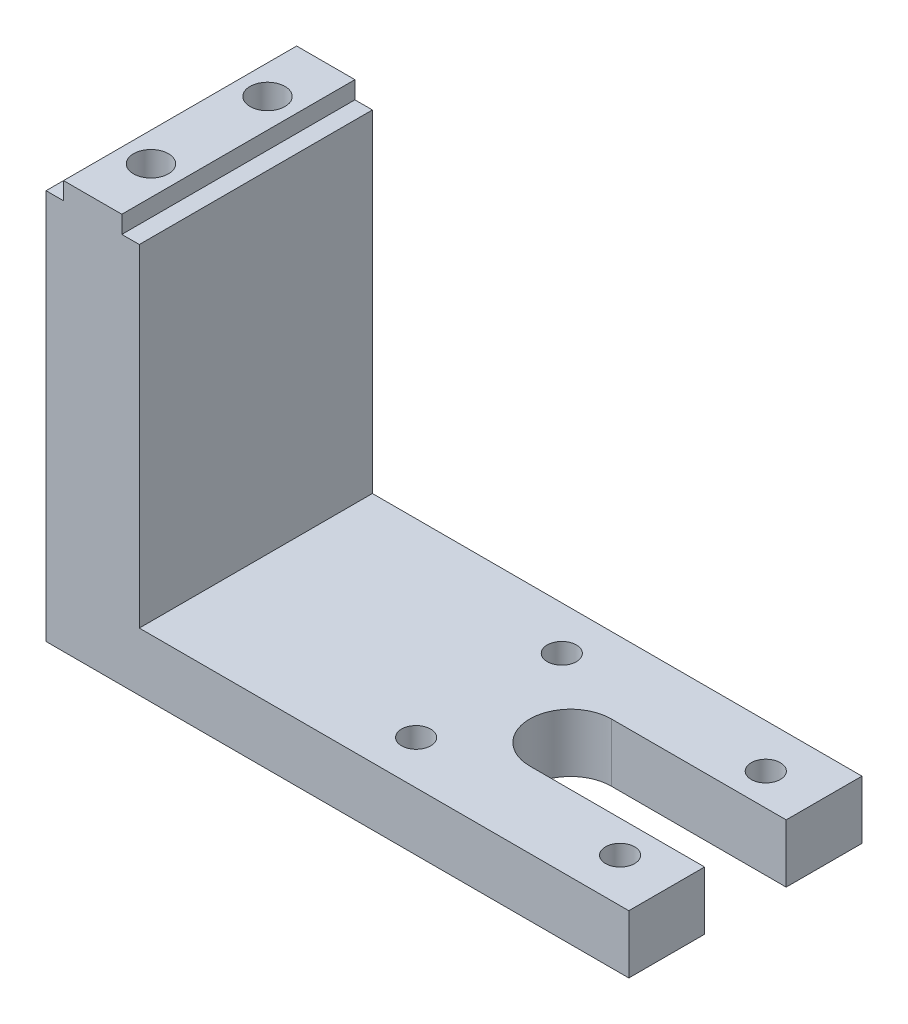
ISO-10303-21;
HEADER;
FILE_DESCRIPTION(('STEP AP214'),'2;1');
FILE_NAME('part.step','',(''),(''),'','','');
FILE_SCHEMA(('AUTOMOTIVE_DESIGN { 1 0 10303 214 1 1 1 1 }'));
ENDSEC;
DATA;
#1=APPLICATION_CONTEXT('core data for automotive mechanical design processes');
#2=APPLICATION_PROTOCOL_DEFINITION('international standard','automotive_design',2000,#1);
#3=PRODUCT_CONTEXT('',#1,'mechanical');
#4=PRODUCT('Part','Part','',(#3));
#5=PRODUCT_RELATED_PRODUCT_CATEGORY('part','',(#4));
#6=PRODUCT_DEFINITION_FORMATION('','',#4);
#7=PRODUCT_DEFINITION_CONTEXT('part definition',#1,'design');
#8=PRODUCT_DEFINITION('design','',#6,#7);
#9=PRODUCT_DEFINITION_SHAPE('','',#8);
#10=(LENGTH_UNIT() NAMED_UNIT(*) SI_UNIT(.MILLI.,.METRE.));
#11=(NAMED_UNIT(*) PLANE_ANGLE_UNIT() SI_UNIT($,.RADIAN.));
#12=(NAMED_UNIT(*) SI_UNIT($,.STERADIAN.) SOLID_ANGLE_UNIT());
#13=UNCERTAINTY_MEASURE_WITH_UNIT(LENGTH_MEASURE(1.E-05),#10,'distance_accuracy_value','');
#14=(GEOMETRIC_REPRESENTATION_CONTEXT(3) GLOBAL_UNCERTAINTY_ASSIGNED_CONTEXT((#13)) GLOBAL_UNIT_ASSIGNED_CONTEXT((#10,
#11,#12)) REPRESENTATION_CONTEXT('',''));
#15=CARTESIAN_POINT('',(0.,0.,0.));
#16=DIRECTION('',(0.,0.,1.));
#17=DIRECTION('',(1.,0.,0.));
#18=AXIS2_PLACEMENT_3D('',#15,#16,#17);
#19=CARTESIAN_POINT('',(84.,0.,20.));
#20=DIRECTION('',(-1.,0.,0.));
#21=DIRECTION('',(0.,0.,1.));
#22=AXIS2_PLACEMENT_3D('',#19,#20,#21);
#23=PLANE('',#22);
#24=DIRECTION('',(0.,0.,-1.));
#25=VECTOR('',#24,1.);
#26=CARTESIAN_POINT('',(84.,-10.,20.));
#27=LINE('',#26,#25);
#28=CARTESIAN_POINT('',(84.,-10.,20.));
#29=VERTEX_POINT('',#28);
#30=CARTESIAN_POINT('',(84.,-10.,7.));
#31=VERTEX_POINT('',#30);
#32=EDGE_CURVE('E139',#29,#31,#27,.T.);
#33=ORIENTED_EDGE('',*,*,#32,.T.);
#34=DIRECTION('',(0.,1.,0.));
#35=VECTOR('',#34,1.);
#36=CARTESIAN_POINT('',(84.,-10.,7.));
#37=LINE('',#36,#35);
#38=CARTESIAN_POINT('',(84.,0.,7.));
#39=VERTEX_POINT('',#38);
#40=EDGE_CURVE('E242',#31,#39,#37,.T.);
#41=ORIENTED_EDGE('',*,*,#40,.T.);
#42=DIRECTION('',(0.,0.,-1.));
#43=VECTOR('',#42,1.);
#44=CARTESIAN_POINT('',(84.,0.,20.));
#45=LINE('',#44,#43);
#46=CARTESIAN_POINT('',(84.,0.,20.));
#47=VERTEX_POINT('',#46);
#48=EDGE_CURVE('E150',#47,#39,#45,.T.);
#49=ORIENTED_EDGE('',*,*,#48,.F.);
#50=DIRECTION('',(0.,1.,0.));
#51=VECTOR('',#50,1.);
#52=CARTESIAN_POINT('',(84.,0.,20.));
#53=LINE('',#52,#51);
#54=EDGE_CURVE('E129',#29,#47,#53,.T.);
#55=ORIENTED_EDGE('',*,*,#54,.F.);
#56=EDGE_LOOP('',(#33,#41,#49,#55));
#57=FACE_BOUND('',#56,.T.);
#58=ADVANCED_FACE('F33',(#57),#23,.F.);
#59=CARTESIAN_POINT('',(0.,57.,20.));
#60=DIRECTION('',(-1.,0.,0.));
#61=DIRECTION('',(0.,0.,1.));
#62=AXIS2_PLACEMENT_3D('',#59,#60,#61);
#63=PLANE('',#62);
#64=DIRECTION('',(0.,1.,0.));
#65=VECTOR('',#64,1.);
#66=CARTESIAN_POINT('',(0.,57.,-20.));
#67=LINE('',#66,#65);
#68=CARTESIAN_POINT('',(0.,0.,-20.));
#69=VERTEX_POINT('',#68);
#70=CARTESIAN_POINT('',(0.,57.,-20.));
#71=VERTEX_POINT('',#70);
#72=EDGE_CURVE('E156',#69,#71,#67,.T.);
#73=ORIENTED_EDGE('',*,*,#72,.T.);
#74=DIRECTION('',(0.,0.,-1.));
#75=VECTOR('',#74,1.);
#76=CARTESIAN_POINT('',(0.,57.,20.));
#77=LINE('',#76,#75);
#78=CARTESIAN_POINT('',(0.,57.,20.));
#79=VERTEX_POINT('',#78);
#80=EDGE_CURVE('E11',#79,#71,#77,.T.);
#81=ORIENTED_EDGE('',*,*,#80,.F.);
#82=DIRECTION('',(0.,1.,0.));
#83=VECTOR('',#82,1.);
#84=CARTESIAN_POINT('',(0.,57.,20.));
#85=LINE('',#84,#83);
#86=CARTESIAN_POINT('',(0.,0.,20.));
#87=VERTEX_POINT('',#86);
#88=EDGE_CURVE('E179',#87,#79,#85,.T.);
#89=ORIENTED_EDGE('',*,*,#88,.F.);
#90=DIRECTION('',(0.,0.,-1.));
#91=VECTOR('',#90,1.);
#92=CARTESIAN_POINT('',(0.,0.,20.));
#93=LINE('',#92,#91);
#94=EDGE_CURVE('E152',#87,#69,#93,.T.);
#95=ORIENTED_EDGE('',*,*,#94,.T.);
#96=EDGE_LOOP('',(#73,#81,#89,#95));
#97=FACE_BOUND('',#96,.T.);
#98=ADVANCED_FACE('F35',(#97),#63,.F.);
#99=CARTESIAN_POINT('',(-3.,57.,20.));
#100=DIRECTION('',(0.,-1.,0.));
#101=DIRECTION('',(0.,0.,-1.));
#102=AXIS2_PLACEMENT_3D('',#99,#100,#101);
#103=PLANE('',#102);
#104=DIRECTION('',(-1.,0.,0.));
#105=VECTOR('',#104,1.);
#106=CARTESIAN_POINT('',(-3.,57.,-20.));
#107=LINE('',#106,#105);
#108=CARTESIAN_POINT('',(-3.,57.,-20.));
#109=VERTEX_POINT('',#108);
#110=EDGE_CURVE('E159',#71,#109,#107,.T.);
#111=ORIENTED_EDGE('',*,*,#110,.T.);
#112=DIRECTION('',(0.,0.,-1.));
#113=VECTOR('',#112,1.);
#114=CARTESIAN_POINT('',(-3.,57.,20.));
#115=LINE('',#114,#113);
#116=CARTESIAN_POINT('',(-3.,57.,20.));
#117=VERTEX_POINT('',#116);
#118=EDGE_CURVE('E41',#117,#109,#115,.T.);
#119=ORIENTED_EDGE('',*,*,#118,.F.);
#120=DIRECTION('',(-1.,0.,0.));
#121=VECTOR('',#120,1.);
#122=CARTESIAN_POINT('',(-3.,57.,20.));
#123=LINE('',#122,#121);
#124=EDGE_CURVE('E103',#79,#117,#123,.T.);
#125=ORIENTED_EDGE('',*,*,#124,.F.);
#126=ORIENTED_EDGE('',*,*,#80,.T.);
#127=EDGE_LOOP('',(#111,#119,#125,#126));
#128=FACE_BOUND('',#127,.T.);
#129=ADVANCED_FACE('F333',(#128),#103,.F.);
#130=CARTESIAN_POINT('',(-3.00000000000001,60.,20.));
#131=DIRECTION('',(-1.,0.,0.));
#132=DIRECTION('',(0.,-1.,0.));
#133=AXIS2_PLACEMENT_3D('',#130,#131,#132);
#134=PLANE('',#133);
#135=DIRECTION('',(0.,1.,0.));
#136=VECTOR('',#135,1.);
#137=CARTESIAN_POINT('',(-3.00000000000001,60.,-20.));
#138=LINE('',#137,#136);
#139=CARTESIAN_POINT('',(-3.00000000000001,60.,-20.));
#140=VERTEX_POINT('',#139);
#141=EDGE_CURVE('E162',#109,#140,#138,.T.);
#142=ORIENTED_EDGE('',*,*,#141,.T.);
#143=DIRECTION('',(0.,0.,-1.));
#144=VECTOR('',#143,1.);
#145=CARTESIAN_POINT('',(-3.00000000000001,60.,20.));
#146=LINE('',#145,#144);
#147=CARTESIAN_POINT('',(-3.00000000000001,60.,20.));
#148=VERTEX_POINT('',#147);
#149=EDGE_CURVE('E193',#148,#140,#146,.T.);
#150=ORIENTED_EDGE('',*,*,#149,.F.);
#151=DIRECTION('',(0.,1.,0.));
#152=VECTOR('',#151,1.);
#153=CARTESIAN_POINT('',(-3.00000000000001,60.,20.));
#154=LINE('',#153,#152);
#155=EDGE_CURVE('E201',#117,#148,#154,.T.);
#156=ORIENTED_EDGE('',*,*,#155,.F.);
#157=ORIENTED_EDGE('',*,*,#118,.T.);
#158=EDGE_LOOP('',(#142,#150,#156,#157));
#159=FACE_BOUND('',#158,.T.);
#160=ADVANCED_FACE('F199',(#159),#134,.F.);
#161=CARTESIAN_POINT('',(-13.,60.,20.));
#162=DIRECTION('',(0.,-1.,0.));
#163=DIRECTION('',(0.,0.,-1.));
#164=AXIS2_PLACEMENT_3D('',#161,#162,#163);
#165=PLANE('',#164);
#166=CARTESIAN_POINT('',(-8.00000000000001,60.,-10.));
#167=DIRECTION('',(0.,1.,0.));
#168=DIRECTION('',(0.,0.,1.));
#169=AXIS2_PLACEMENT_3D('',#166,#167,#168);
#170=CIRCLE('',#169,3.);
#171=CARTESIAN_POINT('',(-8.00000000000001,60.,-7.));
#172=VERTEX_POINT('',#171);
#173=EDGE_CURVE('E234',#172,#172,#170,.T.);
#174=ORIENTED_EDGE('',*,*,#173,.F.);
#175=EDGE_LOOP('',(#174));
#176=FACE_BOUND('',#175,.T.);
#177=CARTESIAN_POINT('',(-8.00000000000001,60.,10.));
#178=DIRECTION('',(0.,1.,0.));
#179=DIRECTION('',(0.,0.,1.));
#180=AXIS2_PLACEMENT_3D('',#177,#178,#179);
#181=CIRCLE('',#180,3.);
#182=CARTESIAN_POINT('',(-8.00000000000001,60.,13.));
#183=VERTEX_POINT('',#182);
#184=EDGE_CURVE('E227',#183,#183,#181,.T.);
#185=ORIENTED_EDGE('',*,*,#184,.F.);
#186=EDGE_LOOP('',(#185));
#187=FACE_BOUND('',#186,.T.);
#188=DIRECTION('',(-1.,0.,0.));
#189=VECTOR('',#188,1.);
#190=CARTESIAN_POINT('',(-13.,60.,-20.));
#191=LINE('',#190,#189);
#192=CARTESIAN_POINT('',(-13.,60.,-20.));
#193=VERTEX_POINT('',#192);
#194=EDGE_CURVE('E164',#140,#193,#191,.T.);
#195=ORIENTED_EDGE('',*,*,#194,.T.);
#196=DIRECTION('',(0.,0.,-1.));
#197=VECTOR('',#196,1.);
#198=CARTESIAN_POINT('',(-13.,60.,20.));
#199=LINE('',#198,#197);
#200=CARTESIAN_POINT('',(-13.,60.,20.));
#201=VERTEX_POINT('',#200);
#202=EDGE_CURVE('E190',#201,#193,#199,.T.);
#203=ORIENTED_EDGE('',*,*,#202,.F.);
#204=DIRECTION('',(-1.,0.,0.));
#205=VECTOR('',#204,1.);
#206=CARTESIAN_POINT('',(-13.,60.,20.));
#207=LINE('',#206,#205);
#208=EDGE_CURVE('E219',#148,#201,#207,.T.);
#209=ORIENTED_EDGE('',*,*,#208,.F.);
#210=ORIENTED_EDGE('',*,*,#149,.T.);
#211=EDGE_LOOP('',(#195,#203,#209,#210));
#212=FACE_BOUND('',#211,.T.);
#213=ADVANCED_FACE('F210',(#176,#187,#212),#165,.F.);
#214=CARTESIAN_POINT('',(-13.,57.,20.));
#215=DIRECTION('',(1.,0.,0.));
#216=DIRECTION('',(0.,1.,0.));
#217=AXIS2_PLACEMENT_3D('',#214,#215,#216);
#218=PLANE('',#217);
#219=DIRECTION('',(0.,-1.,0.));
#220=VECTOR('',#219,1.);
#221=CARTESIAN_POINT('',(-13.,57.,-20.));
#222=LINE('',#221,#220);
#223=CARTESIAN_POINT('',(-13.,57.,-20.));
#224=VERTEX_POINT('',#223);
#225=EDGE_CURVE('E166',#193,#224,#222,.T.);
#226=ORIENTED_EDGE('',*,*,#225,.T.);
#227=DIRECTION('',(0.,0.,-1.));
#228=VECTOR('',#227,1.);
#229=CARTESIAN_POINT('',(-13.,57.,20.));
#230=LINE('',#229,#228);
#231=CARTESIAN_POINT('',(-13.,57.,20.));
#232=VERTEX_POINT('',#231);
#233=EDGE_CURVE('E187',#232,#224,#230,.T.);
#234=ORIENTED_EDGE('',*,*,#233,.F.);
#235=DIRECTION('',(0.,-1.,0.));
#236=VECTOR('',#235,1.);
#237=CARTESIAN_POINT('',(-13.,57.,20.));
#238=LINE('',#237,#236);
#239=EDGE_CURVE('E216',#201,#232,#238,.T.);
#240=ORIENTED_EDGE('',*,*,#239,.F.);
#241=ORIENTED_EDGE('',*,*,#202,.T.);
#242=EDGE_LOOP('',(#226,#234,#240,#241));
#243=FACE_BOUND('',#242,.T.);
#244=ADVANCED_FACE('F214',(#243),#218,.F.);
#245=CARTESIAN_POINT('',(-16.,57.,20.));
#246=DIRECTION('',(0.,-1.,0.));
#247=DIRECTION('',(1.,0.,0.));
#248=AXIS2_PLACEMENT_3D('',#245,#246,#247);
#249=PLANE('',#248);
#250=DIRECTION('',(-1.,0.,0.));
#251=VECTOR('',#250,1.);
#252=CARTESIAN_POINT('',(-16.,57.,-20.));
#253=LINE('',#252,#251);
#254=CARTESIAN_POINT('',(-16.,57.,-20.));
#255=VERTEX_POINT('',#254);
#256=EDGE_CURVE('E168',#224,#255,#253,.T.);
#257=ORIENTED_EDGE('',*,*,#256,.T.);
#258=DIRECTION('',(0.,0.,-1.));
#259=VECTOR('',#258,1.);
#260=CARTESIAN_POINT('',(-16.,57.,20.));
#261=LINE('',#260,#259);
#262=CARTESIAN_POINT('',(-16.,57.,20.));
#263=VERTEX_POINT('',#262);
#264=EDGE_CURVE('E184',#263,#255,#261,.T.);
#265=ORIENTED_EDGE('',*,*,#264,.F.);
#266=DIRECTION('',(-1.,0.,0.));
#267=VECTOR('',#266,1.);
#268=CARTESIAN_POINT('',(-16.,57.,20.));
#269=LINE('',#268,#267);
#270=EDGE_CURVE('E218',#232,#263,#269,.T.);
#271=ORIENTED_EDGE('',*,*,#270,.F.);
#272=ORIENTED_EDGE('',*,*,#233,.T.);
#273=EDGE_LOOP('',(#257,#265,#271,#272));
#274=FACE_BOUND('',#273,.T.);
#275=ADVANCED_FACE('F354',(#274),#249,.F.);
#276=CARTESIAN_POINT('',(-16.,-10.,20.));
#277=DIRECTION('',(1.,0.,0.));
#278=DIRECTION('',(0.,1.,0.));
#279=AXIS2_PLACEMENT_3D('',#276,#277,#278);
#280=PLANE('',#279);
#281=DIRECTION('',(0.,-1.,0.));
#282=VECTOR('',#281,1.);
#283=CARTESIAN_POINT('',(-16.,-10.,-20.));
#284=LINE('',#283,#282);
#285=CARTESIAN_POINT('',(-16.,-10.,-20.));
#286=VERTEX_POINT('',#285);
#287=EDGE_CURVE('E170',#255,#286,#284,.T.);
#288=ORIENTED_EDGE('',*,*,#287,.T.);
#289=DIRECTION('',(0.,0.,-1.));
#290=VECTOR('',#289,1.);
#291=CARTESIAN_POINT('',(-16.,-10.,20.));
#292=LINE('',#291,#290);
#293=CARTESIAN_POINT('',(-16.,-10.,20.));
#294=VERTEX_POINT('',#293);
#295=EDGE_CURVE('E146',#294,#286,#292,.T.);
#296=ORIENTED_EDGE('',*,*,#295,.F.);
#297=DIRECTION('',(0.,-1.,0.));
#298=VECTOR('',#297,1.);
#299=CARTESIAN_POINT('',(-16.,-10.,20.));
#300=LINE('',#299,#298);
#301=EDGE_CURVE('E132',#263,#294,#300,.T.);
#302=ORIENTED_EDGE('',*,*,#301,.F.);
#303=ORIENTED_EDGE('',*,*,#264,.T.);
#304=EDGE_LOOP('',(#288,#296,#302,#303));
#305=FACE_BOUND('',#304,.T.);
#306=ADVANCED_FACE('F349',(#305),#280,.F.);
#307=CARTESIAN_POINT('',(84.,-10.,20.));
#308=DIRECTION('',(0.,1.,0.));
#309=DIRECTION('',(-1.,0.,0.));
#310=AXIS2_PLACEMENT_3D('',#307,#308,#309);
#311=PLANE('',#310);
#312=CARTESIAN_POINT('',(40.,-10.,-12.5));
#313=DIRECTION('',(0.,1.,0.));
#314=DIRECTION('',(0.,0.,-1.));
#315=AXIS2_PLACEMENT_3D('',#312,#313,#314);
#316=CIRCLE('',#315,2.5);
#317=CARTESIAN_POINT('',(40.,-10.,-15.));
#318=VERTEX_POINT('',#317);
#319=EDGE_CURVE('E248',#318,#318,#316,.T.);
#320=ORIENTED_EDGE('',*,*,#319,.T.);
#321=EDGE_LOOP('',(#320));
#322=FACE_BOUND('',#321,.T.);
#323=CARTESIAN_POINT('',(75.,-10.,12.5));
#324=DIRECTION('',(0.,1.,0.));
#325=DIRECTION('',(0.,0.,1.));
#326=AXIS2_PLACEMENT_3D('',#323,#324,#325);
#327=CIRCLE('',#326,2.5);
#328=CARTESIAN_POINT('',(75.,-10.,15.));
#329=VERTEX_POINT('',#328);
#330=EDGE_CURVE('E249',#329,#329,#327,.T.);
#331=ORIENTED_EDGE('',*,*,#330,.T.);
#332=EDGE_LOOP('',(#331));
#333=FACE_BOUND('',#332,.T.);
#334=CARTESIAN_POINT('',(75.,-10.,-12.5));
#335=DIRECTION('',(0.,1.,0.));
#336=DIRECTION('',(0.,0.,-1.));
#337=AXIS2_PLACEMENT_3D('',#334,#335,#336);
#338=CIRCLE('',#337,2.5);
#339=CARTESIAN_POINT('',(75.,-10.,-15.));
#340=VERTEX_POINT('',#339);
#341=EDGE_CURVE('E277',#340,#340,#338,.T.);
#342=ORIENTED_EDGE('',*,*,#341,.T.);
#343=EDGE_LOOP('',(#342));
#344=FACE_BOUND('',#343,.T.);
#345=CARTESIAN_POINT('',(40.,-10.,12.5));
#346=DIRECTION('',(0.,1.,0.));
#347=DIRECTION('',(0.,0.,1.));
#348=AXIS2_PLACEMENT_3D('',#345,#346,#347);
#349=CIRCLE('',#348,2.5);
#350=CARTESIAN_POINT('',(40.,-10.,15.));
#351=VERTEX_POINT('',#350);
#352=EDGE_CURVE('E231',#351,#351,#349,.T.);
#353=ORIENTED_EDGE('',*,*,#352,.T.);
#354=EDGE_LOOP('',(#353));
#355=FACE_BOUND('',#354,.T.);
#356=CARTESIAN_POINT('',(54.,-10.,0.));
#357=DIRECTION('',(0.,1.,0.));
#358=DIRECTION('',(0.,0.,-1.));
#359=AXIS2_PLACEMENT_3D('',#356,#357,#358);
#360=CIRCLE('',#359,7.);
#361=CARTESIAN_POINT('',(54.,-10.,-7.));
#362=VERTEX_POINT('',#361);
#363=CARTESIAN_POINT('',(54.,-10.,7.));
#364=VERTEX_POINT('',#363);
#365=EDGE_CURVE('E270',#362,#364,#360,.T.);
#366=ORIENTED_EDGE('',*,*,#365,.T.);
#367=DIRECTION('',(1.,0.,0.));
#368=VECTOR('',#367,1.);
#369=CARTESIAN_POINT('',(84.,-10.,7.));
#370=LINE('',#369,#368);
#371=EDGE_CURVE('E143',#364,#31,#370,.T.);
#372=ORIENTED_EDGE('',*,*,#371,.T.);
#373=ORIENTED_EDGE('',*,*,#32,.F.);
#374=DIRECTION('',(1.,0.,0.));
#375=VECTOR('',#374,1.);
#376=CARTESIAN_POINT('',(84.,-10.,20.));
#377=LINE('',#376,#375);
#378=EDGE_CURVE('E125',#294,#29,#377,.T.);
#379=ORIENTED_EDGE('',*,*,#378,.F.);
#380=ORIENTED_EDGE('',*,*,#295,.T.);
#381=DIRECTION('',(1.,0.,0.));
#382=VECTOR('',#381,1.);
#383=CARTESIAN_POINT('',(84.,-10.,-20.));
#384=LINE('',#383,#382);
#385=CARTESIAN_POINT('',(84.,-10.,-20.));
#386=VERTEX_POINT('',#385);
#387=EDGE_CURVE('E172',#286,#386,#384,.T.);
#388=ORIENTED_EDGE('',*,*,#387,.T.);
#389=CARTESIAN_POINT('',(84.,-10.,-7.));
#390=VERTEX_POINT('',#389);
#391=EDGE_CURVE('E147',#390,#386,#27,.T.);
#392=ORIENTED_EDGE('',*,*,#391,.F.);
#393=DIRECTION('',(-1.,0.,0.));
#394=VECTOR('',#393,1.);
#395=CARTESIAN_POINT('',(84.,-10.,-7.));
#396=LINE('',#395,#394);
#397=EDGE_CURVE('E264',#390,#362,#396,.T.);
#398=ORIENTED_EDGE('',*,*,#397,.T.);
#399=EDGE_LOOP('',(#366,#372,#373,#379,#380,#388,#392,#398));
#400=FACE_BOUND('',#399,.T.);
#401=ADVANCED_FACE('F141',(#322,#333,#344,#355,#400),#311,.F.);
#402=CARTESIAN_POINT('',(84.,0.,-7.));
#403=VERTEX_POINT('',#402);
#404=CARTESIAN_POINT('',(84.,0.,-20.));
#405=VERTEX_POINT('',#404);
#406=EDGE_CURVE('E181',#403,#405,#45,.T.);
#407=ORIENTED_EDGE('',*,*,#406,.F.);
#408=DIRECTION('',(0.,1.,0.));
#409=VECTOR('',#408,1.);
#410=CARTESIAN_POINT('',(84.,-10.,-7.));
#411=LINE('',#410,#409);
#412=EDGE_CURVE('E48',#390,#403,#411,.T.);
#413=ORIENTED_EDGE('',*,*,#412,.F.);
#414=ORIENTED_EDGE('',*,*,#391,.T.);
#415=DIRECTION('',(0.,1.,0.));
#416=VECTOR('',#415,1.);
#417=CARTESIAN_POINT('',(84.,0.,-20.));
#418=LINE('',#417,#416);
#419=EDGE_CURVE('E175',#386,#405,#418,.T.);
#420=ORIENTED_EDGE('',*,*,#419,.T.);
#421=EDGE_LOOP('',(#407,#413,#414,#420));
#422=FACE_BOUND('',#421,.T.);
#423=ADVANCED_FACE('F299',(#422),#23,.F.);
#424=CARTESIAN_POINT('',(0.,0.,20.));
#425=DIRECTION('',(0.,-1.,0.));
#426=DIRECTION('',(0.,0.,-1.));
#427=AXIS2_PLACEMENT_3D('',#424,#425,#426);
#428=PLANE('',#427);
#429=CARTESIAN_POINT('',(40.,0.,-12.5));
#430=DIRECTION('',(0.,1.,0.));
#431=DIRECTION('',(0.,0.,-1.));
#432=AXIS2_PLACEMENT_3D('',#429,#430,#431);
#433=CIRCLE('',#432,2.5);
#434=CARTESIAN_POINT('',(40.,0.,-15.));
#435=VERTEX_POINT('',#434);
#436=EDGE_CURVE('E245',#435,#435,#433,.T.);
#437=ORIENTED_EDGE('',*,*,#436,.F.);
#438=EDGE_LOOP('',(#437));
#439=FACE_BOUND('',#438,.T.);
#440=CARTESIAN_POINT('',(75.,0.,12.5));
#441=DIRECTION('',(0.,1.,0.));
#442=DIRECTION('',(0.,0.,1.));
#443=AXIS2_PLACEMENT_3D('',#440,#441,#442);
#444=CIRCLE('',#443,2.5);
#445=CARTESIAN_POINT('',(75.,0.,15.));
#446=VERTEX_POINT('',#445);
#447=EDGE_CURVE('E280',#446,#446,#444,.T.);
#448=ORIENTED_EDGE('',*,*,#447,.F.);
#449=EDGE_LOOP('',(#448));
#450=FACE_BOUND('',#449,.T.);
#451=CARTESIAN_POINT('',(75.,0.,-12.5));
#452=DIRECTION('',(0.,1.,0.));
#453=DIRECTION('',(0.,0.,-1.));
#454=AXIS2_PLACEMENT_3D('',#451,#452,#453);
#455=CIRCLE('',#454,2.5);
#456=CARTESIAN_POINT('',(75.,0.,-15.));
#457=VERTEX_POINT('',#456);
#458=EDGE_CURVE('E274',#457,#457,#455,.T.);
#459=ORIENTED_EDGE('',*,*,#458,.F.);
#460=EDGE_LOOP('',(#459));
#461=FACE_BOUND('',#460,.T.);
#462=CARTESIAN_POINT('',(40.,0.,12.5));
#463=DIRECTION('',(0.,1.,0.));
#464=DIRECTION('',(0.,0.,1.));
#465=AXIS2_PLACEMENT_3D('',#462,#463,#464);
#466=CIRCLE('',#465,2.5);
#467=CARTESIAN_POINT('',(40.,0.,15.));
#468=VERTEX_POINT('',#467);
#469=EDGE_CURVE('E239',#468,#468,#466,.T.);
#470=ORIENTED_EDGE('',*,*,#469,.F.);
#471=EDGE_LOOP('',(#470));
#472=FACE_BOUND('',#471,.T.);
#473=ORIENTED_EDGE('',*,*,#48,.T.);
#474=DIRECTION('',(1.,0.,0.));
#475=VECTOR('',#474,1.);
#476=CARTESIAN_POINT('',(84.,0.,7.));
#477=LINE('',#476,#475);
#478=CARTESIAN_POINT('',(54.,0.,7.));
#479=VERTEX_POINT('',#478);
#480=EDGE_CURVE('E261',#479,#39,#477,.T.);
#481=ORIENTED_EDGE('',*,*,#480,.F.);
#482=CARTESIAN_POINT('',(54.,0.,0.));
#483=DIRECTION('',(0.,1.,0.));
#484=DIRECTION('',(0.,0.,-1.));
#485=AXIS2_PLACEMENT_3D('',#482,#483,#484);
#486=CIRCLE('',#485,7.);
#487=CARTESIAN_POINT('',(54.,0.,-7.));
#488=VERTEX_POINT('',#487);
#489=EDGE_CURVE('E265',#488,#479,#486,.T.);
#490=ORIENTED_EDGE('',*,*,#489,.F.);
#491=DIRECTION('',(-1.,0.,0.));
#492=VECTOR('',#491,1.);
#493=CARTESIAN_POINT('',(84.,0.,-7.));
#494=LINE('',#493,#492);
#495=EDGE_CURVE('E252',#403,#488,#494,.T.);
#496=ORIENTED_EDGE('',*,*,#495,.F.);
#497=ORIENTED_EDGE('',*,*,#406,.T.);
#498=DIRECTION('',(-1.,0.,0.));
#499=VECTOR('',#498,1.);
#500=CARTESIAN_POINT('',(0.,0.,-20.));
#501=LINE('',#500,#499);
#502=EDGE_CURVE('E95',#405,#69,#501,.T.);
#503=ORIENTED_EDGE('',*,*,#502,.T.);
#504=ORIENTED_EDGE('',*,*,#94,.F.);
#505=DIRECTION('',(-1.,0.,0.));
#506=VECTOR('',#505,1.);
#507=CARTESIAN_POINT('',(0.,0.,20.));
#508=LINE('',#507,#506);
#509=EDGE_CURVE('E57',#47,#87,#508,.T.);
#510=ORIENTED_EDGE('',*,*,#509,.F.);
#511=EDGE_LOOP('',(#473,#481,#490,#496,#497,#503,#504,#510));
#512=FACE_BOUND('',#511,.T.);
#513=ADVANCED_FACE('F296',(#439,#450,#461,#472,#512),#428,.F.);
#514=CARTESIAN_POINT('',(0.,0.,20.));
#515=DIRECTION('',(0.,0.,1.));
#516=DIRECTION('',(1.,0.,0.));
#517=AXIS2_PLACEMENT_3D('',#514,#515,#516);
#518=PLANE('',#517);
#519=ORIENTED_EDGE('',*,*,#88,.T.);
#520=ORIENTED_EDGE('',*,*,#124,.T.);
#521=ORIENTED_EDGE('',*,*,#155,.T.);
#522=ORIENTED_EDGE('',*,*,#208,.T.);
#523=ORIENTED_EDGE('',*,*,#239,.T.);
#524=ORIENTED_EDGE('',*,*,#270,.T.);
#525=ORIENTED_EDGE('',*,*,#301,.T.);
#526=ORIENTED_EDGE('',*,*,#378,.T.);
#527=ORIENTED_EDGE('',*,*,#54,.T.);
#528=ORIENTED_EDGE('',*,*,#509,.T.);
#529=EDGE_LOOP('',(#519,#520,#521,#522,#523,#524,#525,#526,#527,#528));
#530=FACE_BOUND('',#529,.T.);
#531=ADVANCED_FACE('F127',(#530),#518,.T.);
#532=CARTESIAN_POINT('',(0.,0.,-20.));
#533=DIRECTION('',(0.,0.,1.));
#534=DIRECTION('',(1.,0.,0.));
#535=AXIS2_PLACEMENT_3D('',#532,#533,#534);
#536=PLANE('',#535);
#537=ORIENTED_EDGE('',*,*,#72,.F.);
#538=ORIENTED_EDGE('',*,*,#502,.F.);
#539=ORIENTED_EDGE('',*,*,#419,.F.);
#540=ORIENTED_EDGE('',*,*,#387,.F.);
#541=ORIENTED_EDGE('',*,*,#287,.F.);
#542=ORIENTED_EDGE('',*,*,#256,.F.);
#543=ORIENTED_EDGE('',*,*,#225,.F.);
#544=ORIENTED_EDGE('',*,*,#194,.F.);
#545=ORIENTED_EDGE('',*,*,#141,.F.);
#546=ORIENTED_EDGE('',*,*,#110,.F.);
#547=EDGE_LOOP('',(#537,#538,#539,#540,#541,#542,#543,#544,#545,#546));
#548=FACE_BOUND('',#547,.T.);
#549=ADVANCED_FACE('F205',(#548),#536,.F.);
#550=CARTESIAN_POINT('',(-8.00000000000001,50.,10.));
#551=DIRECTION('',(0.,1.,0.));
#552=DIRECTION('',(0.,0.,1.));
#553=AXIS2_PLACEMENT_3D('',#550,#551,#552);
#554=CYLINDRICAL_SURFACE('',#553,3.);
#555=CARTESIAN_POINT('',(-8.00000000000001,50.,10.));
#556=DIRECTION('',(0.,1.,0.));
#557=DIRECTION('',(0.,0.,1.));
#558=AXIS2_PLACEMENT_3D('',#555,#556,#557);
#559=CIRCLE('',#558,3.);
#560=CARTESIAN_POINT('',(-8.00000000000001,50.,13.));
#561=VERTEX_POINT('',#560);
#562=EDGE_CURVE('E230',#561,#561,#559,.T.);
#563=ORIENTED_EDGE('',*,*,#562,.F.);
#564=EDGE_LOOP('',(#563));
#565=FACE_BOUND('',#564,.T.);
#566=ORIENTED_EDGE('',*,*,#184,.T.);
#567=EDGE_LOOP('',(#566));
#568=FACE_BOUND('',#567,.T.);
#569=ADVANCED_FACE('F371',(#565,#568),#554,.F.);
#570=CARTESIAN_POINT('',(-8.00000000000001,50.,10.));
#571=DIRECTION('',(0.,1.,0.));
#572=DIRECTION('',(0.,0.,1.));
#573=AXIS2_PLACEMENT_3D('',#570,#571,#572);
#574=PLANE('',#573);
#575=ORIENTED_EDGE('',*,*,#562,.T.);
#576=EDGE_LOOP('',(#575));
#577=FACE_BOUND('',#576,.T.);
#578=ADVANCED_FACE('F373',(#577),#574,.T.);
#579=CARTESIAN_POINT('',(-8.00000000000001,50.,-10.));
#580=DIRECTION('',(0.,1.,0.));
#581=DIRECTION('',(0.,0.,1.));
#582=AXIS2_PLACEMENT_3D('',#579,#580,#581);
#583=CYLINDRICAL_SURFACE('',#582,3.);
#584=CARTESIAN_POINT('',(-8.00000000000001,50.,-10.));
#585=DIRECTION('',(0.,1.,0.));
#586=DIRECTION('',(0.,0.,1.));
#587=AXIS2_PLACEMENT_3D('',#584,#585,#586);
#588=CIRCLE('',#587,3.);
#589=CARTESIAN_POINT('',(-8.00000000000001,50.,-7.));
#590=VERTEX_POINT('',#589);
#591=EDGE_CURVE('E160',#590,#590,#588,.T.);
#592=ORIENTED_EDGE('',*,*,#591,.F.);
#593=EDGE_LOOP('',(#592));
#594=FACE_BOUND('',#593,.T.);
#595=ORIENTED_EDGE('',*,*,#173,.T.);
#596=EDGE_LOOP('',(#595));
#597=FACE_BOUND('',#596,.T.);
#598=ADVANCED_FACE('F380',(#594,#597),#583,.F.);
#599=CARTESIAN_POINT('',(-8.00000000000001,50.,-10.));
#600=DIRECTION('',(0.,1.,0.));
#601=DIRECTION('',(0.,0.,1.));
#602=AXIS2_PLACEMENT_3D('',#599,#600,#601);
#603=PLANE('',#602);
#604=ORIENTED_EDGE('',*,*,#591,.T.);
#605=EDGE_LOOP('',(#604));
#606=FACE_BOUND('',#605,.T.);
#607=ADVANCED_FACE('F422',(#606),#603,.T.);
#608=CARTESIAN_POINT('',(40.,-10.,12.5));
#609=DIRECTION('',(0.,1.,0.));
#610=DIRECTION('',(0.,0.,1.));
#611=AXIS2_PLACEMENT_3D('',#608,#609,#610);
#612=CYLINDRICAL_SURFACE('',#611,2.5);
#613=ORIENTED_EDGE('',*,*,#352,.F.);
#614=EDGE_LOOP('',(#613));
#615=FACE_BOUND('',#614,.T.);
#616=ORIENTED_EDGE('',*,*,#469,.T.);
#617=EDGE_LOOP('',(#616));
#618=FACE_BOUND('',#617,.T.);
#619=ADVANCED_FACE('F430',(#615,#618),#612,.F.);
#620=CARTESIAN_POINT('',(75.,-10.,-12.5));
#621=DIRECTION('',(0.,1.,0.));
#622=DIRECTION('',(0.,0.,1.));
#623=AXIS2_PLACEMENT_3D('',#620,#621,#622);
#624=CYLINDRICAL_SURFACE('',#623,2.5);
#625=ORIENTED_EDGE('',*,*,#341,.F.);
#626=EDGE_LOOP('',(#625));
#627=FACE_BOUND('',#626,.T.);
#628=ORIENTED_EDGE('',*,*,#458,.T.);
#629=EDGE_LOOP('',(#628));
#630=FACE_BOUND('',#629,.T.);
#631=ADVANCED_FACE('F292',(#627,#630),#624,.F.);
#632=CARTESIAN_POINT('',(75.,-10.,12.5));
#633=DIRECTION('',(0.,1.,0.));
#634=DIRECTION('',(0.,0.,1.));
#635=AXIS2_PLACEMENT_3D('',#632,#633,#634);
#636=CYLINDRICAL_SURFACE('',#635,2.5);
#637=ORIENTED_EDGE('',*,*,#330,.F.);
#638=EDGE_LOOP('',(#637));
#639=FACE_BOUND('',#638,.T.);
#640=ORIENTED_EDGE('',*,*,#447,.T.);
#641=EDGE_LOOP('',(#640));
#642=FACE_BOUND('',#641,.T.);
#643=ADVANCED_FACE('F288',(#639,#642),#636,.F.);
#644=CARTESIAN_POINT('',(40.,-10.,-12.5));
#645=DIRECTION('',(0.,1.,0.));
#646=DIRECTION('',(0.,0.,1.));
#647=AXIS2_PLACEMENT_3D('',#644,#645,#646);
#648=CYLINDRICAL_SURFACE('',#647,2.5);
#649=ORIENTED_EDGE('',*,*,#319,.F.);
#650=EDGE_LOOP('',(#649));
#651=FACE_BOUND('',#650,.T.);
#652=ORIENTED_EDGE('',*,*,#436,.T.);
#653=EDGE_LOOP('',(#652));
#654=FACE_BOUND('',#653,.T.);
#655=ADVANCED_FACE('F291',(#651,#654),#648,.F.);
#656=CARTESIAN_POINT('',(84.,-10.,7.));
#657=DIRECTION('',(0.,0.,1.));
#658=DIRECTION('',(1.,0.,0.));
#659=AXIS2_PLACEMENT_3D('',#656,#657,#658);
#660=PLANE('',#659);
#661=ORIENTED_EDGE('',*,*,#480,.T.);
#662=ORIENTED_EDGE('',*,*,#40,.F.);
#663=ORIENTED_EDGE('',*,*,#371,.F.);
#664=DIRECTION('',(0.,1.,0.));
#665=VECTOR('',#664,1.);
#666=CARTESIAN_POINT('',(54.,-10.,7.));
#667=LINE('',#666,#665);
#668=EDGE_CURVE('E257',#364,#479,#667,.T.);
#669=ORIENTED_EDGE('',*,*,#668,.T.);
#670=EDGE_LOOP('',(#661,#662,#663,#669));
#671=FACE_BOUND('',#670,.T.);
#672=ADVANCED_FACE('F482',(#671),#660,.F.);
#673=CARTESIAN_POINT('',(54.,-10.,0.));
#674=DIRECTION('',(0.,1.,0.));
#675=DIRECTION('',(0.,0.,1.));
#676=AXIS2_PLACEMENT_3D('',#673,#674,#675);
#677=CYLINDRICAL_SURFACE('',#676,7.);
#678=ORIENTED_EDGE('',*,*,#489,.T.);
#679=ORIENTED_EDGE('',*,*,#668,.F.);
#680=ORIENTED_EDGE('',*,*,#365,.F.);
#681=DIRECTION('',(0.,1.,0.));
#682=VECTOR('',#681,1.);
#683=CARTESIAN_POINT('',(54.,-10.,-7.));
#684=LINE('',#683,#682);
#685=EDGE_CURVE('E254',#362,#488,#684,.T.);
#686=ORIENTED_EDGE('',*,*,#685,.T.);
#687=EDGE_LOOP('',(#678,#679,#680,#686));
#688=FACE_BOUND('',#687,.T.);
#689=ADVANCED_FACE('F324',(#688),#677,.F.);
#690=CARTESIAN_POINT('',(84.,-10.,-7.));
#691=DIRECTION('',(0.,0.,-1.));
#692=DIRECTION('',(-1.,0.,0.));
#693=AXIS2_PLACEMENT_3D('',#690,#691,#692);
#694=PLANE('',#693);
#695=ORIENTED_EDGE('',*,*,#495,.T.);
#696=ORIENTED_EDGE('',*,*,#685,.F.);
#697=ORIENTED_EDGE('',*,*,#397,.F.);
#698=ORIENTED_EDGE('',*,*,#412,.T.);
#699=EDGE_LOOP('',(#695,#696,#697,#698));
#700=FACE_BOUND('',#699,.T.);
#701=ADVANCED_FACE('F322',(#700),#694,.F.);
#702=CLOSED_SHELL('',(#58,#98,#129,#160,#213,#244,#275,#306,#401,#423,#513,#531,#549,#569,#578,
#598,#607,#619,#631,#643,#655,#672,#689,#701));
#703=MANIFOLD_SOLID_BREP('B2',#702);
#704=ADVANCED_BREP_SHAPE_REPRESENTATION('',(#18,#703),#14);
#705=SHAPE_DEFINITION_REPRESENTATION(#9,#704);
ENDSEC;
END-ISO-10303-21;
